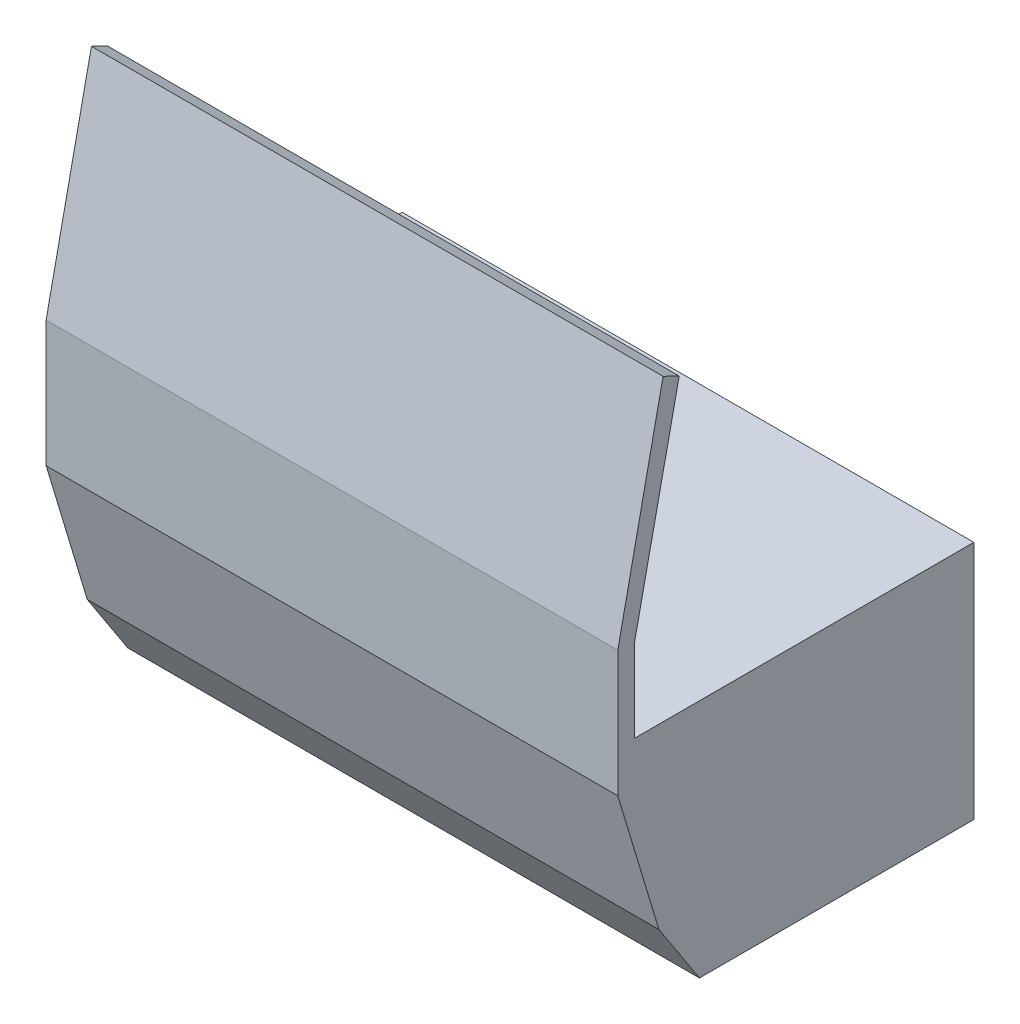
ISO-10303-21;
HEADER;
FILE_DESCRIPTION(('STEP AP214'),'2;1');
FILE_NAME('part.step','',(''),(''),'','','');
FILE_SCHEMA(('AUTOMOTIVE_DESIGN { 1 0 10303 214 1 1 1 1 }'));
ENDSEC;
DATA;
#1=APPLICATION_CONTEXT('core data for automotive mechanical design processes');
#2=APPLICATION_PROTOCOL_DEFINITION('international standard','automotive_design',2000,#1);
#3=PRODUCT_CONTEXT('',#1,'mechanical');
#4=PRODUCT('Part','Part','',(#3));
#5=PRODUCT_RELATED_PRODUCT_CATEGORY('part','',(#4));
#6=PRODUCT_DEFINITION_FORMATION('','',#4);
#7=PRODUCT_DEFINITION_CONTEXT('part definition',#1,'design');
#8=PRODUCT_DEFINITION('design','',#6,#7);
#9=PRODUCT_DEFINITION_SHAPE('','',#8);
#10=(LENGTH_UNIT() NAMED_UNIT(*) SI_UNIT(.MILLI.,.METRE.));
#11=(NAMED_UNIT(*) PLANE_ANGLE_UNIT() SI_UNIT($,.RADIAN.));
#12=(NAMED_UNIT(*) SI_UNIT($,.STERADIAN.) SOLID_ANGLE_UNIT());
#13=UNCERTAINTY_MEASURE_WITH_UNIT(LENGTH_MEASURE(1.E-05),#10,'distance_accuracy_value','');
#14=(GEOMETRIC_REPRESENTATION_CONTEXT(3) GLOBAL_UNCERTAINTY_ASSIGNED_CONTEXT((#13)) GLOBAL_UNIT_ASSIGNED_CONTEXT((#10,
#11,#12)) REPRESENTATION_CONTEXT('',''));
#15=CARTESIAN_POINT('',(0.,0.,0.));
#16=DIRECTION('',(0.,0.,1.));
#17=DIRECTION('',(1.,0.,0.));
#18=AXIS2_PLACEMENT_3D('',#15,#16,#17);
#19=CARTESIAN_POINT('',(0.,1050.,1200.));
#20=DIRECTION('',(-1.,0.,0.));
#21=DIRECTION('',(0.,0.,1.));
#22=AXIS2_PLACEMENT_3D('',#19,#20,#21);
#23=PLANE('',#22);
#24=DIRECTION('',(0.,1.,0.));
#25=VECTOR('',#24,1.);
#26=CARTESIAN_POINT('',(0.,1050.,0.));
#27=LINE('',#26,#25);
#28=CARTESIAN_POINT('',(0.,0.,0.));
#29=VERTEX_POINT('',#28);
#30=CARTESIAN_POINT('',(0.,1050.,0.));
#31=VERTEX_POINT('',#30);
#32=EDGE_CURVE('E252',#29,#31,#27,.T.);
#33=ORIENTED_EDGE('',*,*,#32,.T.);
#34=DIRECTION('',(0.,0.,-1.));
#35=VECTOR('',#34,1.);
#36=CARTESIAN_POINT('',(0.,1050.,1200.));
#37=LINE('',#36,#35);
#38=CARTESIAN_POINT('',(0.,1050.,1483.97372499962));
#39=VERTEX_POINT('',#38);
#40=EDGE_CURVE('E11',#39,#31,#37,.T.);
#41=ORIENTED_EDGE('',*,*,#40,.F.);
#42=DIRECTION('',(0.,1.,0.));
#43=VECTOR('',#42,1.);
#44=CARTESIAN_POINT('',(0.,1050.,1483.97372499962));
#45=LINE('',#44,#43);
#46=CARTESIAN_POINT('',(0.,1412.88178216531,1483.97372499962));
#47=VERTEX_POINT('',#46);
#48=EDGE_CURVE('E163',#39,#47,#45,.T.);
#49=ORIENTED_EDGE('',*,*,#48,.T.);
#50=DIRECTION('',(0.,0.977783346406544,-0.209618051441234));
#51=VECTOR('',#50,1.);
#52=CARTESIAN_POINT('',(0.,1412.88178216531,1483.97372499962));
#53=LINE('',#52,#51);
#54=CARTESIAN_POINT('',(0.,2324.11311768727,1288.62315202628));
#55=VERTEX_POINT('',#54);
#56=EDGE_CURVE('E202',#47,#55,#53,.T.);
#57=ORIENTED_EDGE('',*,*,#56,.T.);
#58=DIRECTION('',(0.,0.43718155326249,0.899373275946643));
#59=VECTOR('',#58,1.);
#60=CARTESIAN_POINT('',(0.,2324.11311768727,1288.62315202628));
#61=LINE('',#60,#59);
#62=CARTESIAN_POINT('',(0.,2358.39375669804,1359.14554799334));
#63=VERTEX_POINT('',#62);
#64=EDGE_CURVE('E206',#55,#63,#61,.T.);
#65=ORIENTED_EDGE('',*,*,#64,.T.);
#66=DIRECTION('',(0.,-0.978423617143952,0.206608870610496));
#67=VECTOR('',#66,1.);
#68=CARTESIAN_POINT('',(0.,2358.39375669804,1359.14554799334));
#69=LINE('',#68,#67);
#70=CARTESIAN_POINT('',(0.,1420.52784038736,1557.19004973855));
#71=VERTEX_POINT('',#70);
#72=EDGE_CURVE('E210',#63,#71,#69,.T.);
#73=ORIENTED_EDGE('',*,*,#72,.T.);
#74=DIRECTION('',(0.,-1.,0.));
#75=VECTOR('',#74,1.);
#76=CARTESIAN_POINT('',(0.,868.710221607082,1557.19004973855));
#77=LINE('',#76,#75);
#78=CARTESIAN_POINT('',(0.,868.710221607082,1557.19004973855));
#79=VERTEX_POINT('',#78);
#80=EDGE_CURVE('E214',#71,#79,#77,.T.);
#81=ORIENTED_EDGE('',*,*,#80,.T.);
#82=DIRECTION('',(0.,-0.957395417900401,-0.288780217091331));
#83=VECTOR('',#82,1.);
#84=CARTESIAN_POINT('',(0.,272.141248376092,1377.24630405257));
#85=LINE('',#84,#83);
#86=CARTESIAN_POINT('',(0.,272.141248376092,1377.24630405257));
#87=VERTEX_POINT('',#86);
#88=EDGE_CURVE('E181',#79,#87,#85,.T.);
#89=ORIENTED_EDGE('',*,*,#88,.T.);
#90=DIRECTION('',(0.,-0.837944508017531,-0.54575544109359));
#91=VECTOR('',#90,1.);
#92=CARTESIAN_POINT('',(0.,272.141248376092,1377.24630405257));
#93=LINE('',#92,#91);
#94=CARTESIAN_POINT('',(0.,0.,1200.));
#95=VERTEX_POINT('',#94);
#96=EDGE_CURVE('E174',#87,#95,#93,.T.);
#97=ORIENTED_EDGE('',*,*,#96,.T.);
#98=DIRECTION('',(0.,0.,-1.));
#99=VECTOR('',#98,1.);
#100=CARTESIAN_POINT('',(0.,0.,1200.));
#101=LINE('',#100,#99);
#102=EDGE_CURVE('E287',#95,#29,#101,.T.);
#103=ORIENTED_EDGE('',*,*,#102,.T.);
#104=EDGE_LOOP('',(#33,#41,#49,#57,#65,#73,#81,#89,#97,#103));
#105=FACE_BOUND('',#104,.T.);
#106=ADVANCED_FACE('F45',(#105),#23,.F.);
#107=CARTESIAN_POINT('',(-2500.,1050.,1200.));
#108=DIRECTION('',(0.,-1.,0.));
#109=DIRECTION('',(1.,0.,0.));
#110=AXIS2_PLACEMENT_3D('',#107,#108,#109);
#111=PLANE('',#110);
#112=DIRECTION('',(-1.,0.,0.));
#113=VECTOR('',#112,1.);
#114=CARTESIAN_POINT('',(-2500.,1050.,0.));
#115=LINE('',#114,#113);
#116=CARTESIAN_POINT('',(-2500.,1050.,0.));
#117=VERTEX_POINT('',#116);
#118=EDGE_CURVE('E152',#31,#117,#115,.T.);
#119=ORIENTED_EDGE('',*,*,#118,.T.);
#120=DIRECTION('',(0.,0.,-1.));
#121=VECTOR('',#120,1.);
#122=CARTESIAN_POINT('',(-2500.,1050.,1200.));
#123=LINE('',#122,#121);
#124=CARTESIAN_POINT('',(-2500.,1050.,1483.97372499962));
#125=VERTEX_POINT('',#124);
#126=EDGE_CURVE('E53',#125,#117,#123,.T.);
#127=ORIENTED_EDGE('',*,*,#126,.F.);
#128=DIRECTION('',(1.,0.,0.));
#129=VECTOR('',#128,1.);
#130=CARTESIAN_POINT('',(-2500.,1050.,1483.97372499962));
#131=LINE('',#130,#129);
#132=EDGE_CURVE('E150',#125,#39,#131,.T.);
#133=ORIENTED_EDGE('',*,*,#132,.T.);
#134=ORIENTED_EDGE('',*,*,#40,.T.);
#135=EDGE_LOOP('',(#119,#127,#133,#134));
#136=FACE_BOUND('',#135,.T.);
#137=ADVANCED_FACE('F149',(#136),#111,.F.);
#138=CARTESIAN_POINT('',(-2500.,-3.06161699786838E-13,1200.));
#139=DIRECTION('',(1.,0.,0.));
#140=DIRECTION('',(0.,0.,-1.));
#141=AXIS2_PLACEMENT_3D('',#138,#139,#140);
#142=PLANE('',#141);
#143=DIRECTION('',(0.,-1.,0.));
#144=VECTOR('',#143,1.);
#145=CARTESIAN_POINT('',(-2500.,-3.06161699786838E-13,0.));
#146=LINE('',#145,#144);
#147=CARTESIAN_POINT('',(-2500.,-3.06161699786838E-13,0.));
#148=VERTEX_POINT('',#147);
#149=EDGE_CURVE('E294',#117,#148,#146,.T.);
#150=ORIENTED_EDGE('',*,*,#149,.T.);
#151=DIRECTION('',(0.,0.,-1.));
#152=VECTOR('',#151,1.);
#153=CARTESIAN_POINT('',(-2500.,-3.06161699786838E-13,1200.));
#154=LINE('',#153,#152);
#155=CARTESIAN_POINT('',(-2500.,0.,1200.));
#156=VERTEX_POINT('',#155);
#157=EDGE_CURVE('E157',#156,#148,#154,.T.);
#158=ORIENTED_EDGE('',*,*,#157,.F.);
#159=DIRECTION('',(0.,-0.837944508017531,-0.54575544109359));
#160=VECTOR('',#159,1.);
#161=CARTESIAN_POINT('',(-2500.,272.141248376092,1377.24630405257));
#162=LINE('',#161,#160);
#163=CARTESIAN_POINT('',(-2500.,272.141248376092,1377.24630405257));
#164=VERTEX_POINT('',#163);
#165=EDGE_CURVE('E166',#164,#156,#162,.T.);
#166=ORIENTED_EDGE('',*,*,#165,.F.);
#167=DIRECTION('',(0.,-0.957395417900401,-0.288780217091331));
#168=VECTOR('',#167,1.);
#169=CARTESIAN_POINT('',(-2500.,272.141248376092,1377.24630405257));
#170=LINE('',#169,#168);
#171=CARTESIAN_POINT('',(-2500.,868.710221607082,1557.19004973855));
#172=VERTEX_POINT('',#171);
#173=EDGE_CURVE('E194',#172,#164,#170,.T.);
#174=ORIENTED_EDGE('',*,*,#173,.F.);
#175=DIRECTION('',(0.,-1.,0.));
#176=VECTOR('',#175,1.);
#177=CARTESIAN_POINT('',(-2500.,1420.52784038736,1557.19004973855));
#178=LINE('',#177,#176);
#179=CARTESIAN_POINT('',(-2500.,1420.52784038736,1557.19004973855));
#180=VERTEX_POINT('',#179);
#181=EDGE_CURVE('E191',#180,#172,#178,.T.);
#182=ORIENTED_EDGE('',*,*,#181,.F.);
#183=DIRECTION('',(0.,-0.978423617143952,0.206608870610496));
#184=VECTOR('',#183,1.);
#185=CARTESIAN_POINT('',(-2500.,2358.39375669804,1359.14554799334));
#186=LINE('',#185,#184);
#187=CARTESIAN_POINT('',(-2500.,2358.39375669804,1359.14554799334));
#188=VERTEX_POINT('',#187);
#189=EDGE_CURVE('E187',#188,#180,#186,.T.);
#190=ORIENTED_EDGE('',*,*,#189,.F.);
#191=DIRECTION('',(0.,0.43718155326249,0.899373275946643));
#192=VECTOR('',#191,1.);
#193=CARTESIAN_POINT('',(-2500.,2324.11311768727,1288.62315202628));
#194=LINE('',#193,#192);
#195=CARTESIAN_POINT('',(-2500.,2324.11311768727,1288.62315202628));
#196=VERTEX_POINT('',#195);
#197=EDGE_CURVE('E178',#196,#188,#194,.T.);
#198=ORIENTED_EDGE('',*,*,#197,.F.);
#199=DIRECTION('',(0.,0.977783346406544,-0.209618051441234));
#200=VECTOR('',#199,1.);
#201=CARTESIAN_POINT('',(-2500.,1412.88178216531,1483.97372499962));
#202=LINE('',#201,#200);
#203=CARTESIAN_POINT('',(-2500.,1412.88178216531,1483.97372499962));
#204=VERTEX_POINT('',#203);
#205=EDGE_CURVE('E172',#204,#196,#202,.T.);
#206=ORIENTED_EDGE('',*,*,#205,.F.);
#207=DIRECTION('',(0.,1.,0.));
#208=VECTOR('',#207,1.);
#209=CARTESIAN_POINT('',(-2500.,1050.,1483.97372499962));
#210=LINE('',#209,#208);
#211=EDGE_CURVE('E161',#125,#204,#210,.T.);
#212=ORIENTED_EDGE('',*,*,#211,.F.);
#213=ORIENTED_EDGE('',*,*,#126,.T.);
#214=EDGE_LOOP('',(#150,#158,#166,#174,#182,#190,#198,#206,#212,#213));
#215=FACE_BOUND('',#214,.T.);
#216=ADVANCED_FACE('F169',(#215),#142,.F.);
#217=CARTESIAN_POINT('',(0.,0.,1200.));
#218=DIRECTION('',(0.,1.,0.));
#219=DIRECTION('',(-1.,0.,0.));
#220=AXIS2_PLACEMENT_3D('',#217,#218,#219);
#221=PLANE('',#220);
#222=DIRECTION('',(1.,0.,0.));
#223=VECTOR('',#222,1.);
#224=CARTESIAN_POINT('',(0.,0.,1200.));
#225=LINE('',#224,#223);
#226=CARTESIAN_POINT('',(-20.,0.,1200.));
#227=VERTEX_POINT('',#226);
#228=EDGE_CURVE('E288',#227,#95,#225,.T.);
#229=ORIENTED_EDGE('',*,*,#228,.F.);
#230=DIRECTION('',(0.,0.,-1.));
#231=VECTOR('',#230,1.);
#232=CARTESIAN_POINT('',(-20.,0.,1200.));
#233=LINE('',#232,#231);
#234=CARTESIAN_POINT('',(-20.,0.,20.));
#235=VERTEX_POINT('',#234);
#236=EDGE_CURVE('E274',#227,#235,#233,.T.);
#237=ORIENTED_EDGE('',*,*,#236,.T.);
#238=DIRECTION('',(1.,0.,0.));
#239=VECTOR('',#238,1.);
#240=CARTESIAN_POINT('',(0.,0.,20.));
#241=LINE('',#240,#239);
#242=CARTESIAN_POINT('',(-2480.,-3.03712406188544E-13,20.));
#243=VERTEX_POINT('',#242);
#244=EDGE_CURVE('E263',#243,#235,#241,.T.);
#245=ORIENTED_EDGE('',*,*,#244,.F.);
#246=DIRECTION('',(0.,0.,-1.));
#247=VECTOR('',#246,1.);
#248=CARTESIAN_POINT('',(-2480.,-3.03712406188544E-13,1200.));
#249=LINE('',#248,#247);
#250=CARTESIAN_POINT('',(-2480.,0.,1200.));
#251=VERTEX_POINT('',#250);
#252=EDGE_CURVE('E260',#251,#243,#249,.T.);
#253=ORIENTED_EDGE('',*,*,#252,.F.);
#254=EDGE_CURVE('E283',#156,#251,#225,.T.);
#255=ORIENTED_EDGE('',*,*,#254,.F.);
#256=ORIENTED_EDGE('',*,*,#157,.T.);
#257=DIRECTION('',(1.,0.,0.));
#258=VECTOR('',#257,1.);
#259=CARTESIAN_POINT('',(0.,0.,0.));
#260=LINE('',#259,#258);
#261=EDGE_CURVE('E68',#148,#29,#260,.T.);
#262=ORIENTED_EDGE('',*,*,#261,.T.);
#263=ORIENTED_EDGE('',*,*,#102,.F.);
#264=EDGE_LOOP('',(#229,#237,#245,#253,#255,#256,#262,#263));
#265=FACE_BOUND('',#264,.T.);
#266=ADVANCED_FACE('F305',(#265),#221,.F.);
#267=CARTESIAN_POINT('',(0.,0.,0.));
#268=DIRECTION('',(0.,0.,-1.));
#269=DIRECTION('',(-1.,0.,0.));
#270=AXIS2_PLACEMENT_3D('',#267,#268,#269);
#271=PLANE('',#270);
#272=ORIENTED_EDGE('',*,*,#32,.F.);
#273=ORIENTED_EDGE('',*,*,#261,.F.);
#274=ORIENTED_EDGE('',*,*,#149,.F.);
#275=ORIENTED_EDGE('',*,*,#118,.F.);
#276=EDGE_LOOP('',(#272,#273,#274,#275));
#277=FACE_BOUND('',#276,.T.);
#278=ADVANCED_FACE('F310',(#277),#271,.T.);
#279=CARTESIAN_POINT('',(-20.,1050.,1200.));
#280=DIRECTION('',(-1.,0.,0.));
#281=DIRECTION('',(0.,0.,1.));
#282=AXIS2_PLACEMENT_3D('',#279,#280,#281);
#283=PLANE('',#282);
#284=DIRECTION('',(0.,1.,0.));
#285=VECTOR('',#284,1.);
#286=CARTESIAN_POINT('',(-20.,0.,20.));
#287=LINE('',#286,#285);
#288=CARTESIAN_POINT('',(-20.,1030.,20.));
#289=VERTEX_POINT('',#288);
#290=EDGE_CURVE('E225',#235,#289,#287,.T.);
#291=ORIENTED_EDGE('',*,*,#290,.F.);
#292=ORIENTED_EDGE('',*,*,#236,.F.);
#293=DIRECTION('',(0.,1.,0.));
#294=VECTOR('',#293,1.);
#295=CARTESIAN_POINT('',(-20.,0.,1200.));
#296=LINE('',#295,#294);
#297=CARTESIAN_POINT('',(-20.,1030.,1200.));
#298=VERTEX_POINT('',#297);
#299=EDGE_CURVE('E264',#227,#298,#296,.T.);
#300=ORIENTED_EDGE('',*,*,#299,.T.);
#301=DIRECTION('',(0.,0.,-1.));
#302=VECTOR('',#301,1.);
#303=CARTESIAN_POINT('',(-20.,1030.,1200.));
#304=LINE('',#303,#302);
#305=EDGE_CURVE('E248',#298,#289,#304,.T.);
#306=ORIENTED_EDGE('',*,*,#305,.T.);
#307=EDGE_LOOP('',(#291,#292,#300,#306));
#308=FACE_BOUND('',#307,.T.);
#309=ADVANCED_FACE('F320',(#308),#283,.T.);
#310=CARTESIAN_POINT('',(-2500.,1030.,1200.));
#311=DIRECTION('',(0.,-1.,0.));
#312=DIRECTION('',(1.,0.,0.));
#313=AXIS2_PLACEMENT_3D('',#310,#311,#312);
#314=PLANE('',#313);
#315=DIRECTION('',(-1.,0.,0.));
#316=VECTOR('',#315,1.);
#317=CARTESIAN_POINT('',(0.,1030.,20.));
#318=LINE('',#317,#316);
#319=CARTESIAN_POINT('',(-2480.,1030.,20.));
#320=VERTEX_POINT('',#319);
#321=EDGE_CURVE('E247',#289,#320,#318,.T.);
#322=ORIENTED_EDGE('',*,*,#321,.F.);
#323=ORIENTED_EDGE('',*,*,#305,.F.);
#324=DIRECTION('',(-1.,0.,0.));
#325=VECTOR('',#324,1.);
#326=CARTESIAN_POINT('',(0.,1030.,1200.));
#327=LINE('',#326,#325);
#328=CARTESIAN_POINT('',(-2480.,1030.,1200.));
#329=VERTEX_POINT('',#328);
#330=EDGE_CURVE('E268',#298,#329,#327,.T.);
#331=ORIENTED_EDGE('',*,*,#330,.T.);
#332=DIRECTION('',(0.,0.,-1.));
#333=VECTOR('',#332,1.);
#334=CARTESIAN_POINT('',(-2480.,1030.,1200.));
#335=LINE('',#334,#333);
#336=EDGE_CURVE('E253',#329,#320,#335,.T.);
#337=ORIENTED_EDGE('',*,*,#336,.T.);
#338=EDGE_LOOP('',(#322,#323,#331,#337));
#339=FACE_BOUND('',#338,.T.);
#340=ADVANCED_FACE('F328',(#339),#314,.T.);
#341=CARTESIAN_POINT('',(-2480.,-3.06161699786838E-13,1200.));
#342=DIRECTION('',(1.,0.,0.));
#343=DIRECTION('',(0.,0.,-1.));
#344=AXIS2_PLACEMENT_3D('',#341,#342,#343);
#345=PLANE('',#344);
#346=DIRECTION('',(0.,-1.,0.));
#347=VECTOR('',#346,1.);
#348=CARTESIAN_POINT('',(-2480.,0.,20.));
#349=LINE('',#348,#347);
#350=EDGE_CURVE('E256',#320,#243,#349,.T.);
#351=ORIENTED_EDGE('',*,*,#350,.F.);
#352=ORIENTED_EDGE('',*,*,#336,.F.);
#353=DIRECTION('',(0.,-1.,0.));
#354=VECTOR('',#353,1.);
#355=CARTESIAN_POINT('',(-2480.,0.,1200.));
#356=LINE('',#355,#354);
#357=EDGE_CURVE('E60',#329,#251,#356,.T.);
#358=ORIENTED_EDGE('',*,*,#357,.T.);
#359=ORIENTED_EDGE('',*,*,#252,.T.);
#360=EDGE_LOOP('',(#351,#352,#358,#359));
#361=FACE_BOUND('',#360,.T.);
#362=ADVANCED_FACE('F326',(#361),#345,.T.);
#363=CARTESIAN_POINT('',(0.,0.,20.));
#364=DIRECTION('',(0.,0.,-1.));
#365=DIRECTION('',(-1.,0.,0.));
#366=AXIS2_PLACEMENT_3D('',#363,#364,#365);
#367=PLANE('',#366);
#368=ORIENTED_EDGE('',*,*,#290,.T.);
#369=ORIENTED_EDGE('',*,*,#321,.T.);
#370=ORIENTED_EDGE('',*,*,#350,.T.);
#371=ORIENTED_EDGE('',*,*,#244,.T.);
#372=EDGE_LOOP('',(#368,#369,#370,#371));
#373=FACE_BOUND('',#372,.T.);
#374=ADVANCED_FACE('F323',(#373),#367,.F.);
#375=CARTESIAN_POINT('',(-2500.,0.,1200.));
#376=DIRECTION('',(0.,0.,-1.));
#377=DIRECTION('',(-1.,0.,0.));
#378=AXIS2_PLACEMENT_3D('',#375,#376,#377);
#379=PLANE('',#378);
#380=ORIENTED_EDGE('',*,*,#299,.F.);
#381=DIRECTION('',(1.,0.,0.));
#382=VECTOR('',#381,1.);
#383=CARTESIAN_POINT('',(-2500.,0.,1200.));
#384=LINE('',#383,#382);
#385=EDGE_CURVE('E221',#251,#227,#384,.T.);
#386=ORIENTED_EDGE('',*,*,#385,.F.);
#387=ORIENTED_EDGE('',*,*,#357,.F.);
#388=ORIENTED_EDGE('',*,*,#330,.F.);
#389=EDGE_LOOP('',(#380,#386,#387,#388));
#390=FACE_BOUND('',#389,.T.);
#391=ADVANCED_FACE('F329',(#390),#379,.T.);
#392=CARTESIAN_POINT('',(-2500.,272.141248376092,1377.24630405257));
#393=DIRECTION('',(0.,-0.54575544109359,0.837944508017531));
#394=DIRECTION('',(0.,-0.837944508017531,-0.54575544109359));
#395=AXIS2_PLACEMENT_3D('',#392,#393,#394);
#396=PLANE('',#395);
#397=ORIENTED_EDGE('',*,*,#96,.F.);
#398=DIRECTION('',(1.,0.,0.));
#399=VECTOR('',#398,1.);
#400=CARTESIAN_POINT('',(-2500.,272.141248376092,1377.24630405257));
#401=LINE('',#400,#399);
#402=EDGE_CURVE('E226',#164,#87,#401,.T.);
#403=ORIENTED_EDGE('',*,*,#402,.F.);
#404=ORIENTED_EDGE('',*,*,#165,.T.);
#405=ORIENTED_EDGE('',*,*,#254,.T.);
#406=ORIENTED_EDGE('',*,*,#385,.T.);
#407=ORIENTED_EDGE('',*,*,#228,.T.);
#408=EDGE_LOOP('',(#397,#403,#404,#405,#406,#407));
#409=FACE_BOUND('',#408,.T.);
#410=ADVANCED_FACE('F317',(#409),#396,.T.);
#411=CARTESIAN_POINT('',(-2500.,272.141248376092,1377.24630405257));
#412=DIRECTION('',(0.,-0.288780217091331,0.957395417900401));
#413=DIRECTION('',(0.,-0.957395417900401,-0.288780217091331));
#414=AXIS2_PLACEMENT_3D('',#411,#412,#413);
#415=PLANE('',#414);
#416=ORIENTED_EDGE('',*,*,#88,.F.);
#417=DIRECTION('',(1.,0.,0.));
#418=VECTOR('',#417,1.);
#419=CARTESIAN_POINT('',(-2500.,868.710221607082,1557.19004973855));
#420=LINE('',#419,#418);
#421=EDGE_CURVE('E229',#172,#79,#420,.T.);
#422=ORIENTED_EDGE('',*,*,#421,.F.);
#423=ORIENTED_EDGE('',*,*,#173,.T.);
#424=ORIENTED_EDGE('',*,*,#402,.T.);
#425=EDGE_LOOP('',(#416,#422,#423,#424));
#426=FACE_BOUND('',#425,.T.);
#427=ADVANCED_FACE('F336',(#426),#415,.T.);
#428=CARTESIAN_POINT('',(-2500.,868.710221607082,1557.19004973855));
#429=DIRECTION('',(0.,0.,1.));
#430=DIRECTION('',(0.,-1.,0.));
#431=AXIS2_PLACEMENT_3D('',#428,#429,#430);
#432=PLANE('',#431);
#433=ORIENTED_EDGE('',*,*,#80,.F.);
#434=DIRECTION('',(1.,0.,0.));
#435=VECTOR('',#434,1.);
#436=CARTESIAN_POINT('',(-2500.,1420.52784038736,1557.19004973855));
#437=LINE('',#436,#435);
#438=EDGE_CURVE('E232',#180,#71,#437,.T.);
#439=ORIENTED_EDGE('',*,*,#438,.F.);
#440=ORIENTED_EDGE('',*,*,#181,.T.);
#441=ORIENTED_EDGE('',*,*,#421,.T.);
#442=EDGE_LOOP('',(#433,#439,#440,#441));
#443=FACE_BOUND('',#442,.T.);
#444=ADVANCED_FACE('F419',(#443),#432,.T.);
#445=CARTESIAN_POINT('',(-2500.,2358.39375669804,1359.14554799334));
#446=DIRECTION('',(0.,0.206608870610496,0.978423617143952));
#447=DIRECTION('',(0.,-0.978423617143952,0.206608870610496));
#448=AXIS2_PLACEMENT_3D('',#445,#446,#447);
#449=PLANE('',#448);
#450=ORIENTED_EDGE('',*,*,#72,.F.);
#451=DIRECTION('',(1.,0.,0.));
#452=VECTOR('',#451,1.);
#453=CARTESIAN_POINT('',(-2500.,2358.39375669804,1359.14554799334));
#454=LINE('',#453,#452);
#455=EDGE_CURVE('E236',#188,#63,#454,.T.);
#456=ORIENTED_EDGE('',*,*,#455,.F.);
#457=ORIENTED_EDGE('',*,*,#189,.T.);
#458=ORIENTED_EDGE('',*,*,#438,.T.);
#459=EDGE_LOOP('',(#450,#456,#457,#458));
#460=FACE_BOUND('',#459,.T.);
#461=ADVANCED_FACE('F429',(#460),#449,.T.);
#462=CARTESIAN_POINT('',(-2500.,2324.11311768727,1288.62315202628));
#463=DIRECTION('',(0.,0.899373275946643,-0.43718155326249));
#464=DIRECTION('',(0.,0.43718155326249,0.899373275946643));
#465=AXIS2_PLACEMENT_3D('',#462,#463,#464);
#466=PLANE('',#465);
#467=ORIENTED_EDGE('',*,*,#64,.F.);
#468=DIRECTION('',(1.,0.,0.));
#469=VECTOR('',#468,1.);
#470=CARTESIAN_POINT('',(-2500.,2324.11311768727,1288.62315202628));
#471=LINE('',#470,#469);
#472=EDGE_CURVE('E239',#196,#55,#471,.T.);
#473=ORIENTED_EDGE('',*,*,#472,.F.);
#474=ORIENTED_EDGE('',*,*,#197,.T.);
#475=ORIENTED_EDGE('',*,*,#455,.T.);
#476=EDGE_LOOP('',(#467,#473,#474,#475));
#477=FACE_BOUND('',#476,.T.);
#478=ADVANCED_FACE('F442',(#477),#466,.T.);
#479=CARTESIAN_POINT('',(-2500.,1412.88178216531,1483.97372499962));
#480=DIRECTION('',(0.,-0.209618051441234,-0.977783346406544));
#481=DIRECTION('',(0.,0.977783346406544,-0.209618051441234));
#482=AXIS2_PLACEMENT_3D('',#479,#480,#481);
#483=PLANE('',#482);
#484=ORIENTED_EDGE('',*,*,#56,.F.);
#485=DIRECTION('',(1.,0.,0.));
#486=VECTOR('',#485,1.);
#487=CARTESIAN_POINT('',(-2500.,1412.88178216531,1483.97372499962));
#488=LINE('',#487,#486);
#489=EDGE_CURVE('E165',#204,#47,#488,.T.);
#490=ORIENTED_EDGE('',*,*,#489,.F.);
#491=ORIENTED_EDGE('',*,*,#205,.T.);
#492=ORIENTED_EDGE('',*,*,#472,.T.);
#493=EDGE_LOOP('',(#484,#490,#491,#492));
#494=FACE_BOUND('',#493,.T.);
#495=ADVANCED_FACE('F452',(#494),#483,.T.);
#496=CARTESIAN_POINT('',(-2500.,1050.,1483.97372499962));
#497=DIRECTION('',(0.,0.,-1.));
#498=DIRECTION('',(-1.,0.,0.));
#499=AXIS2_PLACEMENT_3D('',#496,#497,#498);
#500=PLANE('',#499);
#501=ORIENTED_EDGE('',*,*,#48,.F.);
#502=ORIENTED_EDGE('',*,*,#132,.F.);
#503=ORIENTED_EDGE('',*,*,#211,.T.);
#504=ORIENTED_EDGE('',*,*,#489,.T.);
#505=EDGE_LOOP('',(#501,#502,#503,#504));
#506=FACE_BOUND('',#505,.T.);
#507=ADVANCED_FACE('F160',(#506),#500,.T.);
#508=CLOSED_SHELL('',(#106,#137,#216,#266,#278,#309,#340,#362,#374,#391,#410,#427,#444,#461,
#478,#495,#507));
#509=MANIFOLD_SOLID_BREP('B2',#508);
#510=ADVANCED_BREP_SHAPE_REPRESENTATION('',(#18,#509),#14);
#511=SHAPE_DEFINITION_REPRESENTATION(#9,#510);
ENDSEC;
END-ISO-10303-21;
